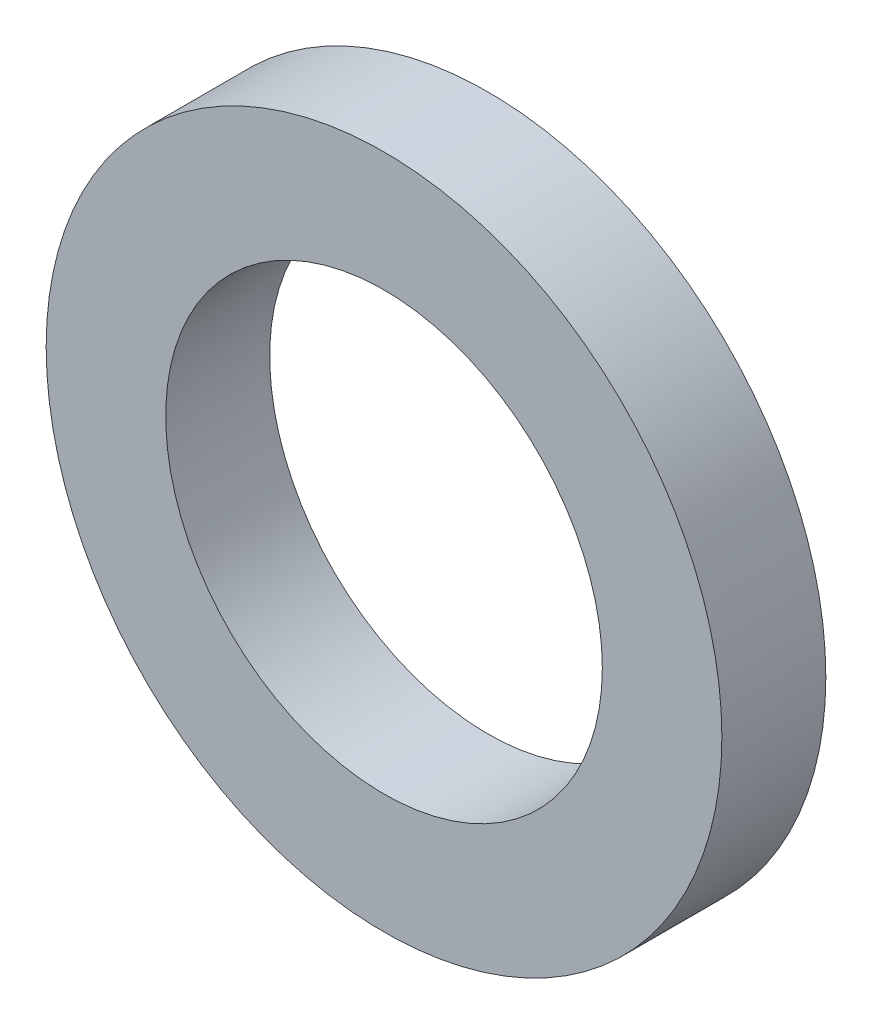
ISO-10303-21;
HEADER;
FILE_DESCRIPTION(('STEP AP214'),'2;1');
FILE_NAME('part.step','',(''),(''),'','','');
FILE_SCHEMA(('AUTOMOTIVE_DESIGN { 1 0 10303 214 1 1 1 1 }'));
ENDSEC;
DATA;
#1=APPLICATION_CONTEXT('core data for automotive mechanical design processes');
#2=APPLICATION_PROTOCOL_DEFINITION('international standard','automotive_design',2000,#1);
#3=PRODUCT_CONTEXT('',#1,'mechanical');
#4=PRODUCT('Part','Part','',(#3));
#5=PRODUCT_RELATED_PRODUCT_CATEGORY('part','',(#4));
#6=PRODUCT_DEFINITION_FORMATION('','',#4);
#7=PRODUCT_DEFINITION_CONTEXT('part definition',#1,'design');
#8=PRODUCT_DEFINITION('design','',#6,#7);
#9=PRODUCT_DEFINITION_SHAPE('','',#8);
#10=(LENGTH_UNIT() NAMED_UNIT(*) SI_UNIT(.MILLI.,.METRE.));
#11=(NAMED_UNIT(*) PLANE_ANGLE_UNIT() SI_UNIT($,.RADIAN.));
#12=(NAMED_UNIT(*) SI_UNIT($,.STERADIAN.) SOLID_ANGLE_UNIT());
#13=UNCERTAINTY_MEASURE_WITH_UNIT(LENGTH_MEASURE(1.E-05),#10,'distance_accuracy_value','');
#14=(GEOMETRIC_REPRESENTATION_CONTEXT(3) GLOBAL_UNCERTAINTY_ASSIGNED_CONTEXT((#13)) GLOBAL_UNIT_ASSIGNED_CONTEXT((#10,
#11,#12)) REPRESENTATION_CONTEXT('',''));
#15=CARTESIAN_POINT('',(0.,0.,0.));
#16=DIRECTION('',(0.,0.,1.));
#17=DIRECTION('',(1.,0.,0.));
#18=AXIS2_PLACEMENT_3D('',#15,#16,#17);
#19=CARTESIAN_POINT('',(0.,0.,2.));
#20=DIRECTION('',(0.,0.,1.));
#21=DIRECTION('',(1.,0.,0.));
#22=AXIS2_PLACEMENT_3D('',#19,#20,#21);
#23=PLANE('',#22);
#24=CARTESIAN_POINT('',(0.,0.,2.));
#25=DIRECTION('',(0.,0.,1.));
#26=DIRECTION('',(1.,0.,0.));
#27=AXIS2_PLACEMENT_3D('',#24,#25,#26);
#28=CIRCLE('',#27,6.5);
#29=CARTESIAN_POINT('',(6.5,0.,2.));
#30=VERTEX_POINT('',#29);
#31=EDGE_CURVE('E10',#30,#30,#28,.T.);
#32=ORIENTED_EDGE('',*,*,#31,.T.);
#33=EDGE_LOOP('',(#32));
#34=FACE_BOUND('',#33,.T.);
#35=CARTESIAN_POINT('',(0.,0.,2.));
#36=DIRECTION('',(0.,0.,1.));
#37=DIRECTION('',(1.,0.,0.));
#38=AXIS2_PLACEMENT_3D('',#35,#36,#37);
#39=CIRCLE('',#38,4.2);
#40=CARTESIAN_POINT('',(4.2,0.,2.));
#41=VERTEX_POINT('',#40);
#42=EDGE_CURVE('E41',#41,#41,#39,.T.);
#43=ORIENTED_EDGE('',*,*,#42,.F.);
#44=EDGE_LOOP('',(#43));
#45=FACE_BOUND('',#44,.T.);
#46=ADVANCED_FACE('F30',(#34,#45),#23,.T.);
#47=CARTESIAN_POINT('',(0.,0.,0.));
#48=DIRECTION('',(0.,0.,1.));
#49=DIRECTION('',(1.,0.,0.));
#50=AXIS2_PLACEMENT_3D('',#47,#48,#49);
#51=PLANE('',#50);
#52=CARTESIAN_POINT('',(0.,0.,0.));
#53=DIRECTION('',(0.,0.,1.));
#54=DIRECTION('',(1.,0.,0.));
#55=AXIS2_PLACEMENT_3D('',#52,#53,#54);
#56=CIRCLE('',#55,6.5);
#57=CARTESIAN_POINT('',(6.5,0.,0.));
#58=VERTEX_POINT('',#57);
#59=EDGE_CURVE('E34',#58,#58,#56,.T.);
#60=ORIENTED_EDGE('',*,*,#59,.F.);
#61=EDGE_LOOP('',(#60));
#62=FACE_BOUND('',#61,.T.);
#63=CARTESIAN_POINT('',(0.,0.,0.));
#64=DIRECTION('',(0.,0.,1.));
#65=DIRECTION('',(1.,0.,0.));
#66=AXIS2_PLACEMENT_3D('',#63,#64,#65);
#67=CIRCLE('',#66,4.2);
#68=CARTESIAN_POINT('',(4.2,0.,0.));
#69=VERTEX_POINT('',#68);
#70=EDGE_CURVE('E43',#69,#69,#67,.T.);
#71=ORIENTED_EDGE('',*,*,#70,.T.);
#72=EDGE_LOOP('',(#71));
#73=FACE_BOUND('',#72,.T.);
#74=ADVANCED_FACE('F53',(#62,#73),#51,.F.);
#75=CARTESIAN_POINT('',(0.,0.,2.));
#76=DIRECTION('',(0.,0.,-1.));
#77=DIRECTION('',(-1.,0.,0.));
#78=AXIS2_PLACEMENT_3D('',#75,#76,#77);
#79=CYLINDRICAL_SURFACE('',#78,6.5);
#80=ORIENTED_EDGE('',*,*,#31,.F.);
#81=EDGE_LOOP('',(#80));
#82=FACE_BOUND('',#81,.T.);
#83=ORIENTED_EDGE('',*,*,#59,.T.);
#84=EDGE_LOOP('',(#83));
#85=FACE_BOUND('',#84,.T.);
#86=ADVANCED_FACE('F32',(#82,#85),#79,.T.);
#87=CARTESIAN_POINT('',(0.,0.,2.));
#88=DIRECTION('',(0.,0.,-1.));
#89=DIRECTION('',(-1.,0.,0.));
#90=AXIS2_PLACEMENT_3D('',#87,#88,#89);
#91=CYLINDRICAL_SURFACE('',#90,4.2);
#92=ORIENTED_EDGE('',*,*,#42,.T.);
#93=EDGE_LOOP('',(#92));
#94=FACE_BOUND('',#93,.T.);
#95=ORIENTED_EDGE('',*,*,#70,.F.);
#96=EDGE_LOOP('',(#95));
#97=FACE_BOUND('',#96,.T.);
#98=ADVANCED_FACE('F49',(#94,#97),#91,.F.);
#99=CLOSED_SHELL('',(#46,#74,#86,#98));
#100=MANIFOLD_SOLID_BREP('B2',#99);
#101=ADVANCED_BREP_SHAPE_REPRESENTATION('',(#18,#100),#14);
#102=SHAPE_DEFINITION_REPRESENTATION(#9,#101);
ENDSEC;
END-ISO-10303-21;
